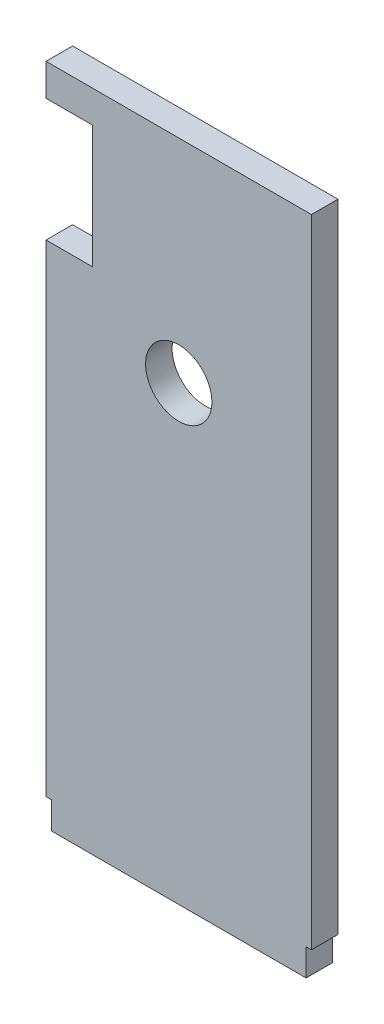
ISO-10303-21;
HEADER;
FILE_DESCRIPTION(('STEP AP214'),'2;1');
FILE_NAME('part.step','',(''),(''),'','','');
FILE_SCHEMA(('AUTOMOTIVE_DESIGN { 1 0 10303 214 1 1 1 1 }'));
ENDSEC;
DATA;
#1=APPLICATION_CONTEXT('core data for automotive mechanical design processes');
#2=APPLICATION_PROTOCOL_DEFINITION('international standard','automotive_design',2000,#1);
#3=PRODUCT_CONTEXT('',#1,'mechanical');
#4=PRODUCT('Part','Part','',(#3));
#5=PRODUCT_RELATED_PRODUCT_CATEGORY('part','',(#4));
#6=PRODUCT_DEFINITION_FORMATION('','',#4);
#7=PRODUCT_DEFINITION_CONTEXT('part definition',#1,'design');
#8=PRODUCT_DEFINITION('design','',#6,#7);
#9=PRODUCT_DEFINITION_SHAPE('','',#8);
#10=(LENGTH_UNIT() NAMED_UNIT(*) SI_UNIT(.MILLI.,.METRE.));
#11=(NAMED_UNIT(*) PLANE_ANGLE_UNIT() SI_UNIT($,.RADIAN.));
#12=(NAMED_UNIT(*) SI_UNIT($,.STERADIAN.) SOLID_ANGLE_UNIT());
#13=UNCERTAINTY_MEASURE_WITH_UNIT(LENGTH_MEASURE(1.E-05),#10,'distance_accuracy_value','');
#14=(GEOMETRIC_REPRESENTATION_CONTEXT(3) GLOBAL_UNCERTAINTY_ASSIGNED_CONTEXT((#13)) GLOBAL_UNIT_ASSIGNED_CONTEXT((#10,
#11,#12)) REPRESENTATION_CONTEXT('',''));
#15=CARTESIAN_POINT('',(0.,0.,0.));
#16=DIRECTION('',(0.,0.,1.));
#17=DIRECTION('',(1.,0.,0.));
#18=AXIS2_PLACEMENT_3D('',#15,#16,#17);
#19=CARTESIAN_POINT('',(0.,0.,6.35));
#20=DIRECTION('',(0.,0.,1.));
#21=DIRECTION('',(1.,0.,0.));
#22=AXIS2_PLACEMENT_3D('',#19,#20,#21);
#23=PLANE('',#22);
#24=DIRECTION('',(0.,-1.,0.));
#25=VECTOR('',#24,1.);
#26=CARTESIAN_POINT('',(62.23,0.,6.35));
#27=LINE('',#26,#25);
#28=CARTESIAN_POINT('',(62.23,6.477,6.35));
#29=VERTEX_POINT('',#28);
#30=CARTESIAN_POINT('',(62.23,0.,6.35));
#31=VERTEX_POINT('',#30);
#32=EDGE_CURVE('E142',#29,#31,#27,.T.);
#33=ORIENTED_EDGE('',*,*,#32,.F.);
#34=DIRECTION('',(-1.,0.,0.));
#35=VECTOR('',#34,1.);
#36=CARTESIAN_POINT('',(63.5,6.477,6.35));
#37=LINE('',#36,#35);
#38=CARTESIAN_POINT('',(63.5,6.477,6.35));
#39=VERTEX_POINT('',#38);
#40=EDGE_CURVE('E123',#39,#29,#37,.T.);
#41=ORIENTED_EDGE('',*,*,#40,.F.);
#42=DIRECTION('',(0.,1.,0.));
#43=VECTOR('',#42,1.);
#44=CARTESIAN_POINT('',(63.5,0.,6.35));
#45=LINE('',#44,#43);
#46=CARTESIAN_POINT('',(63.5,158.877,6.35));
#47=VERTEX_POINT('',#46);
#48=EDGE_CURVE('E179',#39,#47,#45,.T.);
#49=ORIENTED_EDGE('',*,*,#48,.T.);
#50=DIRECTION('',(-1.,0.,0.));
#51=VECTOR('',#50,1.);
#52=CARTESIAN_POINT('',(0.,158.877,6.35));
#53=LINE('',#52,#51);
#54=CARTESIAN_POINT('',(0.,158.877,6.35));
#55=VERTEX_POINT('',#54);
#56=EDGE_CURVE('E181',#47,#55,#53,.T.);
#57=ORIENTED_EDGE('',*,*,#56,.T.);
#58=DIRECTION('',(0.,-1.,0.));
#59=VECTOR('',#58,1.);
#60=CARTESIAN_POINT('',(0.,158.877,6.35));
#61=LINE('',#60,#59);
#62=CARTESIAN_POINT('',(0.,151.2062,6.35));
#63=VERTEX_POINT('',#62);
#64=EDGE_CURVE('E183',#55,#63,#61,.T.);
#65=ORIENTED_EDGE('',*,*,#64,.T.);
#66=DIRECTION('',(1.,0.,0.));
#67=VECTOR('',#66,1.);
#68=CARTESIAN_POINT('',(0.,151.2062,6.35));
#69=LINE('',#68,#67);
#70=CARTESIAN_POINT('',(11.0998,151.2062,6.35));
#71=VERTEX_POINT('',#70);
#72=EDGE_CURVE('E185',#63,#71,#69,.T.);
#73=ORIENTED_EDGE('',*,*,#72,.T.);
#74=DIRECTION('',(0.,-1.,0.));
#75=VECTOR('',#74,1.);
#76=CARTESIAN_POINT('',(11.0998,151.2062,6.35));
#77=LINE('',#76,#75);
#78=CARTESIAN_POINT('',(11.0998,121.8438,6.35));
#79=VERTEX_POINT('',#78);
#80=EDGE_CURVE('E187',#71,#79,#77,.T.);
#81=ORIENTED_EDGE('',*,*,#80,.T.);
#82=DIRECTION('',(-1.,0.,0.));
#83=VECTOR('',#82,1.);
#84=CARTESIAN_POINT('',(11.0998,121.8438,6.35));
#85=LINE('',#84,#83);
#86=CARTESIAN_POINT('',(0.,121.8438,6.35));
#87=VERTEX_POINT('',#86);
#88=EDGE_CURVE('E189',#79,#87,#85,.T.);
#89=ORIENTED_EDGE('',*,*,#88,.T.);
#90=DIRECTION('',(0.,-1.,0.));
#91=VECTOR('',#90,1.);
#92=CARTESIAN_POINT('',(0.,121.8438,6.35));
#93=LINE('',#92,#91);
#94=CARTESIAN_POINT('',(0.,6.477,6.35));
#95=VERTEX_POINT('',#94);
#96=EDGE_CURVE('E172',#87,#95,#93,.T.);
#97=ORIENTED_EDGE('',*,*,#96,.T.);
#98=DIRECTION('',(-1.,0.,0.));
#99=VECTOR('',#98,1.);
#100=CARTESIAN_POINT('',(0.,6.477,6.35));
#101=LINE('',#100,#99);
#102=CARTESIAN_POINT('',(1.27000000000001,6.477,6.35));
#103=VERTEX_POINT('',#102);
#104=EDGE_CURVE('E152',#103,#95,#101,.T.);
#105=ORIENTED_EDGE('',*,*,#104,.F.);
#106=DIRECTION('',(0.,1.,0.));
#107=VECTOR('',#106,1.);
#108=CARTESIAN_POINT('',(1.27,0.,6.35));
#109=LINE('',#108,#107);
#110=CARTESIAN_POINT('',(1.27,0.,6.35));
#111=VERTEX_POINT('',#110);
#112=EDGE_CURVE('E147',#111,#103,#109,.T.);
#113=ORIENTED_EDGE('',*,*,#112,.F.);
#114=DIRECTION('',(1.,0.,0.));
#115=VECTOR('',#114,1.);
#116=CARTESIAN_POINT('',(0.,0.,6.35));
#117=LINE('',#116,#115);
#118=EDGE_CURVE('E175',#111,#31,#117,.T.);
#119=ORIENTED_EDGE('',*,*,#118,.T.);
#120=EDGE_LOOP('',(#33,#41,#49,#57,#65,#73,#81,#89,#97,#105,#113,#119));
#121=FACE_BOUND('',#120,.T.);
#122=CARTESIAN_POINT('',(31.75,108.077,6.35));
#123=DIRECTION('',(0.,0.,1.));
#124=DIRECTION('',(1.,0.,0.));
#125=AXIS2_PLACEMENT_3D('',#122,#123,#124);
#126=CIRCLE('',#125,7.93750000000002);
#127=CARTESIAN_POINT('',(39.6875,108.077,6.35));
#128=VERTEX_POINT('',#127);
#129=EDGE_CURVE('E166',#128,#128,#126,.T.);
#130=ORIENTED_EDGE('',*,*,#129,.F.);
#131=EDGE_LOOP('',(#130));
#132=FACE_BOUND('',#131,.T.);
#133=ADVANCED_FACE('F32',(#121,#132),#23,.T.);
#134=CARTESIAN_POINT('',(0.,0.,0.));
#135=DIRECTION('',(0.,0.,1.));
#136=DIRECTION('',(1.,0.,0.));
#137=AXIS2_PLACEMENT_3D('',#134,#135,#136);
#138=PLANE('',#137);
#139=DIRECTION('',(-1.,0.,0.));
#140=VECTOR('',#139,1.);
#141=CARTESIAN_POINT('',(63.5,6.477,0.));
#142=LINE('',#141,#140);
#143=CARTESIAN_POINT('',(63.5,6.477,0.));
#144=VERTEX_POINT('',#143);
#145=CARTESIAN_POINT('',(62.23,6.477,0.));
#146=VERTEX_POINT('',#145);
#147=EDGE_CURVE('E47',#144,#146,#142,.T.);
#148=ORIENTED_EDGE('',*,*,#147,.T.);
#149=DIRECTION('',(0.,-1.,0.));
#150=VECTOR('',#149,1.);
#151=CARTESIAN_POINT('',(62.23,0.,0.));
#152=LINE('',#151,#150);
#153=CARTESIAN_POINT('',(62.23,0.,0.));
#154=VERTEX_POINT('',#153);
#155=EDGE_CURVE('E130',#146,#154,#152,.T.);
#156=ORIENTED_EDGE('',*,*,#155,.T.);
#157=DIRECTION('',(1.,0.,0.));
#158=VECTOR('',#157,1.);
#159=CARTESIAN_POINT('',(0.,0.,0.));
#160=LINE('',#159,#158);
#161=CARTESIAN_POINT('',(1.27000000000001,0.,0.));
#162=VERTEX_POINT('',#161);
#163=EDGE_CURVE('E194',#162,#154,#160,.T.);
#164=ORIENTED_EDGE('',*,*,#163,.F.);
#165=DIRECTION('',(0.,1.,0.));
#166=VECTOR('',#165,1.);
#167=CARTESIAN_POINT('',(1.27,0.,0.));
#168=LINE('',#167,#166);
#169=CARTESIAN_POINT('',(1.27000000000001,6.477,0.));
#170=VERTEX_POINT('',#169);
#171=EDGE_CURVE('E55',#162,#170,#168,.T.);
#172=ORIENTED_EDGE('',*,*,#171,.T.);
#173=DIRECTION('',(-1.,0.,0.));
#174=VECTOR('',#173,1.);
#175=CARTESIAN_POINT('',(0.,6.477,0.));
#176=LINE('',#175,#174);
#177=CARTESIAN_POINT('',(0.,6.477,0.));
#178=VERTEX_POINT('',#177);
#179=EDGE_CURVE('E151',#170,#178,#176,.T.);
#180=ORIENTED_EDGE('',*,*,#179,.T.);
#181=DIRECTION('',(0.,-1.,0.));
#182=VECTOR('',#181,1.);
#183=CARTESIAN_POINT('',(0.,121.8438,0.));
#184=LINE('',#183,#182);
#185=CARTESIAN_POINT('',(0.,121.8438,0.));
#186=VERTEX_POINT('',#185);
#187=EDGE_CURVE('E169',#186,#178,#184,.T.);
#188=ORIENTED_EDGE('',*,*,#187,.F.);
#189=DIRECTION('',(-1.,0.,0.));
#190=VECTOR('',#189,1.);
#191=CARTESIAN_POINT('',(11.0998,121.8438,0.));
#192=LINE('',#191,#190);
#193=CARTESIAN_POINT('',(11.0998,121.8438,0.));
#194=VERTEX_POINT('',#193);
#195=EDGE_CURVE('E176',#194,#186,#192,.T.);
#196=ORIENTED_EDGE('',*,*,#195,.F.);
#197=DIRECTION('',(0.,-1.,0.));
#198=VECTOR('',#197,1.);
#199=CARTESIAN_POINT('',(11.0998,151.2062,0.));
#200=LINE('',#199,#198);
#201=CARTESIAN_POINT('',(11.0998,151.2062,0.));
#202=VERTEX_POINT('',#201);
#203=EDGE_CURVE('E203',#202,#194,#200,.T.);
#204=ORIENTED_EDGE('',*,*,#203,.F.);
#205=DIRECTION('',(1.,0.,0.));
#206=VECTOR('',#205,1.);
#207=CARTESIAN_POINT('',(0.,151.2062,0.));
#208=LINE('',#207,#206);
#209=CARTESIAN_POINT('',(0.,151.2062,0.));
#210=VERTEX_POINT('',#209);
#211=EDGE_CURVE('E201',#210,#202,#208,.T.);
#212=ORIENTED_EDGE('',*,*,#211,.F.);
#213=DIRECTION('',(0.,-1.,0.));
#214=VECTOR('',#213,1.);
#215=CARTESIAN_POINT('',(0.,158.877,0.));
#216=LINE('',#215,#214);
#217=CARTESIAN_POINT('',(0.,158.877,0.));
#218=VERTEX_POINT('',#217);
#219=EDGE_CURVE('E199',#218,#210,#216,.T.);
#220=ORIENTED_EDGE('',*,*,#219,.F.);
#221=DIRECTION('',(-1.,0.,0.));
#222=VECTOR('',#221,1.);
#223=CARTESIAN_POINT('',(0.,158.877,0.));
#224=LINE('',#223,#222);
#225=CARTESIAN_POINT('',(63.5,158.877,0.));
#226=VERTEX_POINT('',#225);
#227=EDGE_CURVE('E197',#226,#218,#224,.T.);
#228=ORIENTED_EDGE('',*,*,#227,.F.);
#229=DIRECTION('',(0.,1.,0.));
#230=VECTOR('',#229,1.);
#231=CARTESIAN_POINT('',(63.5,0.,0.));
#232=LINE('',#231,#230);
#233=EDGE_CURVE('E141',#144,#226,#232,.T.);
#234=ORIENTED_EDGE('',*,*,#233,.F.);
#235=EDGE_LOOP('',(#148,#156,#164,#172,#180,#188,#196,#204,#212,#220,#228,#234));
#236=FACE_BOUND('',#235,.T.);
#237=CARTESIAN_POINT('',(31.75,108.077,0.));
#238=DIRECTION('',(0.,0.,1.));
#239=DIRECTION('',(1.,0.,0.));
#240=AXIS2_PLACEMENT_3D('',#237,#238,#239);
#241=CIRCLE('',#240,7.93750000000002);
#242=CARTESIAN_POINT('',(39.6875,108.077,0.));
#243=VERTEX_POINT('',#242);
#244=EDGE_CURVE('E162',#243,#243,#241,.T.);
#245=ORIENTED_EDGE('',*,*,#244,.T.);
#246=EDGE_LOOP('',(#245));
#247=FACE_BOUND('',#246,.T.);
#248=ADVANCED_FACE('F138',(#236,#247),#138,.F.);
#249=CARTESIAN_POINT('',(0.,121.8438,6.35));
#250=DIRECTION('',(1.,0.,0.));
#251=DIRECTION('',(0.,1.,0.));
#252=AXIS2_PLACEMENT_3D('',#249,#250,#251);
#253=PLANE('',#252);
#254=ORIENTED_EDGE('',*,*,#187,.T.);
#255=DIRECTION('',(0.,0.,1.));
#256=VECTOR('',#255,1.);
#257=CARTESIAN_POINT('',(0.,6.477,0.));
#258=LINE('',#257,#256);
#259=EDGE_CURVE('E159',#178,#95,#258,.T.);
#260=ORIENTED_EDGE('',*,*,#259,.T.);
#261=ORIENTED_EDGE('',*,*,#96,.F.);
#262=DIRECTION('',(0.,0.,-1.));
#263=VECTOR('',#262,1.);
#264=CARTESIAN_POINT('',(0.,121.8438,6.35));
#265=LINE('',#264,#263);
#266=EDGE_CURVE('E191',#87,#186,#265,.T.);
#267=ORIENTED_EDGE('',*,*,#266,.T.);
#268=EDGE_LOOP('',(#254,#260,#261,#267));
#269=FACE_BOUND('',#268,.T.);
#270=ADVANCED_FACE('F34',(#269),#253,.F.);
#271=CARTESIAN_POINT('',(0.,0.,6.35));
#272=DIRECTION('',(0.,1.,0.));
#273=DIRECTION('',(0.,0.,1.));
#274=AXIS2_PLACEMENT_3D('',#271,#272,#273);
#275=PLANE('',#274);
#276=ORIENTED_EDGE('',*,*,#163,.T.);
#277=DIRECTION('',(0.,0.,1.));
#278=VECTOR('',#277,1.);
#279=CARTESIAN_POINT('',(62.23,0.,0.));
#280=LINE('',#279,#278);
#281=EDGE_CURVE('E126',#154,#31,#280,.T.);
#282=ORIENTED_EDGE('',*,*,#281,.T.);
#283=ORIENTED_EDGE('',*,*,#118,.F.);
#284=DIRECTION('',(0.,0.,1.));
#285=VECTOR('',#284,1.);
#286=CARTESIAN_POINT('',(1.27,0.,0.));
#287=LINE('',#286,#285);
#288=EDGE_CURVE('E155',#162,#111,#287,.T.);
#289=ORIENTED_EDGE('',*,*,#288,.F.);
#290=EDGE_LOOP('',(#276,#282,#283,#289));
#291=FACE_BOUND('',#290,.T.);
#292=ADVANCED_FACE('F248',(#291),#275,.F.);
#293=CARTESIAN_POINT('',(63.5,0.,6.35));
#294=DIRECTION('',(-1.,0.,0.));
#295=DIRECTION('',(0.,-1.,0.));
#296=AXIS2_PLACEMENT_3D('',#293,#294,#295);
#297=PLANE('',#296);
#298=ORIENTED_EDGE('',*,*,#48,.F.);
#299=DIRECTION('',(0.,0.,1.));
#300=VECTOR('',#299,1.);
#301=CARTESIAN_POINT('',(63.5,6.477,0.));
#302=LINE('',#301,#300);
#303=EDGE_CURVE('E127',#144,#39,#302,.T.);
#304=ORIENTED_EDGE('',*,*,#303,.F.);
#305=ORIENTED_EDGE('',*,*,#233,.T.);
#306=DIRECTION('',(0.,0.,-1.));
#307=VECTOR('',#306,1.);
#308=CARTESIAN_POINT('',(63.5,158.877,6.35));
#309=LINE('',#308,#307);
#310=EDGE_CURVE('E11',#47,#226,#309,.T.);
#311=ORIENTED_EDGE('',*,*,#310,.F.);
#312=EDGE_LOOP('',(#298,#304,#305,#311));
#313=FACE_BOUND('',#312,.T.);
#314=ADVANCED_FACE('F244',(#313),#297,.F.);
#315=CARTESIAN_POINT('',(0.,158.877,6.35));
#316=DIRECTION('',(0.,-1.,0.));
#317=DIRECTION('',(0.,0.,-1.));
#318=AXIS2_PLACEMENT_3D('',#315,#316,#317);
#319=PLANE('',#318);
#320=ORIENTED_EDGE('',*,*,#227,.T.);
#321=DIRECTION('',(0.,0.,-1.));
#322=VECTOR('',#321,1.);
#323=CARTESIAN_POINT('',(0.,158.877,6.35));
#324=LINE('',#323,#322);
#325=EDGE_CURVE('E40',#55,#218,#324,.T.);
#326=ORIENTED_EDGE('',*,*,#325,.F.);
#327=ORIENTED_EDGE('',*,*,#56,.F.);
#328=ORIENTED_EDGE('',*,*,#310,.T.);
#329=EDGE_LOOP('',(#320,#326,#327,#328));
#330=FACE_BOUND('',#329,.T.);
#331=ADVANCED_FACE('F242',(#330),#319,.F.);
#332=CARTESIAN_POINT('',(0.,158.877,6.35));
#333=DIRECTION('',(1.,0.,0.));
#334=DIRECTION('',(0.,1.,0.));
#335=AXIS2_PLACEMENT_3D('',#332,#333,#334);
#336=PLANE('',#335);
#337=ORIENTED_EDGE('',*,*,#219,.T.);
#338=DIRECTION('',(0.,0.,-1.));
#339=VECTOR('',#338,1.);
#340=CARTESIAN_POINT('',(0.,151.2062,6.35));
#341=LINE('',#340,#339);
#342=EDGE_CURVE('E214',#63,#210,#341,.T.);
#343=ORIENTED_EDGE('',*,*,#342,.F.);
#344=ORIENTED_EDGE('',*,*,#64,.F.);
#345=ORIENTED_EDGE('',*,*,#325,.T.);
#346=EDGE_LOOP('',(#337,#343,#344,#345));
#347=FACE_BOUND('',#346,.T.);
#348=ADVANCED_FACE('F221',(#347),#336,.F.);
#349=CARTESIAN_POINT('',(0.,151.2062,6.35));
#350=DIRECTION('',(0.,1.,0.));
#351=DIRECTION('',(0.,0.,1.));
#352=AXIS2_PLACEMENT_3D('',#349,#350,#351);
#353=PLANE('',#352);
#354=ORIENTED_EDGE('',*,*,#211,.T.);
#355=DIRECTION('',(0.,0.,-1.));
#356=VECTOR('',#355,1.);
#357=CARTESIAN_POINT('',(11.0998,151.2062,6.35));
#358=LINE('',#357,#356);
#359=EDGE_CURVE('E211',#71,#202,#358,.T.);
#360=ORIENTED_EDGE('',*,*,#359,.F.);
#361=ORIENTED_EDGE('',*,*,#72,.F.);
#362=ORIENTED_EDGE('',*,*,#342,.T.);
#363=EDGE_LOOP('',(#354,#360,#361,#362));
#364=FACE_BOUND('',#363,.T.);
#365=ADVANCED_FACE('F230',(#364),#353,.F.);
#366=CARTESIAN_POINT('',(11.0998,151.2062,6.35));
#367=DIRECTION('',(1.,0.,0.));
#368=DIRECTION('',(0.,1.,0.));
#369=AXIS2_PLACEMENT_3D('',#366,#367,#368);
#370=PLANE('',#369);
#371=ORIENTED_EDGE('',*,*,#203,.T.);
#372=DIRECTION('',(0.,0.,-1.));
#373=VECTOR('',#372,1.);
#374=CARTESIAN_POINT('',(11.0998,121.8438,6.35));
#375=LINE('',#374,#373);
#376=EDGE_CURVE('E208',#79,#194,#375,.T.);
#377=ORIENTED_EDGE('',*,*,#376,.F.);
#378=ORIENTED_EDGE('',*,*,#80,.F.);
#379=ORIENTED_EDGE('',*,*,#359,.T.);
#380=EDGE_LOOP('',(#371,#377,#378,#379));
#381=FACE_BOUND('',#380,.T.);
#382=ADVANCED_FACE('F234',(#381),#370,.F.);
#383=CARTESIAN_POINT('',(11.0998,121.8438,6.35));
#384=DIRECTION('',(0.,-1.,0.));
#385=DIRECTION('',(0.,0.,-1.));
#386=AXIS2_PLACEMENT_3D('',#383,#384,#385);
#387=PLANE('',#386);
#388=ORIENTED_EDGE('',*,*,#195,.T.);
#389=ORIENTED_EDGE('',*,*,#266,.F.);
#390=ORIENTED_EDGE('',*,*,#88,.F.);
#391=ORIENTED_EDGE('',*,*,#376,.T.);
#392=EDGE_LOOP('',(#388,#389,#390,#391));
#393=FACE_BOUND('',#392,.T.);
#394=ADVANCED_FACE('F255',(#393),#387,.F.);
#395=CARTESIAN_POINT('',(31.75,108.077,6.35));
#396=DIRECTION('',(0.,0.,-1.));
#397=DIRECTION('',(-1.,0.,0.));
#398=AXIS2_PLACEMENT_3D('',#395,#396,#397);
#399=CYLINDRICAL_SURFACE('',#398,7.93750000000002);
#400=ORIENTED_EDGE('',*,*,#129,.T.);
#401=EDGE_LOOP('',(#400));
#402=FACE_BOUND('',#401,.T.);
#403=ORIENTED_EDGE('',*,*,#244,.F.);
#404=EDGE_LOOP('',(#403));
#405=FACE_BOUND('',#404,.T.);
#406=ADVANCED_FACE('F257',(#402,#405),#399,.F.);
#407=CARTESIAN_POINT('',(0.,6.477,0.));
#408=DIRECTION('',(0.,1.,0.));
#409=DIRECTION('',(0.,0.,1.));
#410=AXIS2_PLACEMENT_3D('',#407,#408,#409);
#411=PLANE('',#410);
#412=ORIENTED_EDGE('',*,*,#104,.T.);
#413=ORIENTED_EDGE('',*,*,#259,.F.);
#414=ORIENTED_EDGE('',*,*,#179,.F.);
#415=DIRECTION('',(0.,0.,1.));
#416=VECTOR('',#415,1.);
#417=CARTESIAN_POINT('',(1.27000000000001,6.477,0.));
#418=LINE('',#417,#416);
#419=EDGE_CURVE('E163',#170,#103,#418,.T.);
#420=ORIENTED_EDGE('',*,*,#419,.T.);
#421=EDGE_LOOP('',(#412,#413,#414,#420));
#422=FACE_BOUND('',#421,.T.);
#423=ADVANCED_FACE('F263',(#422),#411,.F.);
#424=CARTESIAN_POINT('',(1.27,0.,0.));
#425=DIRECTION('',(1.,0.,0.));
#426=DIRECTION('',(0.,1.,0.));
#427=AXIS2_PLACEMENT_3D('',#424,#425,#426);
#428=PLANE('',#427);
#429=ORIENTED_EDGE('',*,*,#112,.T.);
#430=ORIENTED_EDGE('',*,*,#419,.F.);
#431=ORIENTED_EDGE('',*,*,#171,.F.);
#432=ORIENTED_EDGE('',*,*,#288,.T.);
#433=EDGE_LOOP('',(#429,#430,#431,#432));
#434=FACE_BOUND('',#433,.T.);
#435=ADVANCED_FACE('F274',(#434),#428,.F.);
#436=CARTESIAN_POINT('',(62.23,0.,0.));
#437=DIRECTION('',(-1.,0.,0.));
#438=DIRECTION('',(0.,0.,1.));
#439=AXIS2_PLACEMENT_3D('',#436,#437,#438);
#440=PLANE('',#439);
#441=ORIENTED_EDGE('',*,*,#32,.T.);
#442=ORIENTED_EDGE('',*,*,#281,.F.);
#443=ORIENTED_EDGE('',*,*,#155,.F.);
#444=DIRECTION('',(0.,0.,1.));
#445=VECTOR('',#444,1.);
#446=CARTESIAN_POINT('',(62.23,6.477,0.));
#447=LINE('',#446,#445);
#448=EDGE_CURVE('E119',#146,#29,#447,.T.);
#449=ORIENTED_EDGE('',*,*,#448,.T.);
#450=EDGE_LOOP('',(#441,#442,#443,#449));
#451=FACE_BOUND('',#450,.T.);
#452=ADVANCED_FACE('F131',(#451),#440,.F.);
#453=CARTESIAN_POINT('',(63.5,6.477,0.));
#454=DIRECTION('',(0.,1.,0.));
#455=DIRECTION('',(0.,0.,1.));
#456=AXIS2_PLACEMENT_3D('',#453,#454,#455);
#457=PLANE('',#456);
#458=ORIENTED_EDGE('',*,*,#40,.T.);
#459=ORIENTED_EDGE('',*,*,#448,.F.);
#460=ORIENTED_EDGE('',*,*,#147,.F.);
#461=ORIENTED_EDGE('',*,*,#303,.T.);
#462=EDGE_LOOP('',(#458,#459,#460,#461));
#463=FACE_BOUND('',#462,.T.);
#464=ADVANCED_FACE('F121',(#463),#457,.F.);
#465=CLOSED_SHELL('',(#133,#248,#270,#292,#314,#331,#348,#365,#382,#394,#406,#423,#435,#452,#464));
#466=MANIFOLD_SOLID_BREP('B2',#465);
#467=ADVANCED_BREP_SHAPE_REPRESENTATION('',(#18,#466),#14);
#468=SHAPE_DEFINITION_REPRESENTATION(#9,#467);
ENDSEC;
END-ISO-10303-21;
